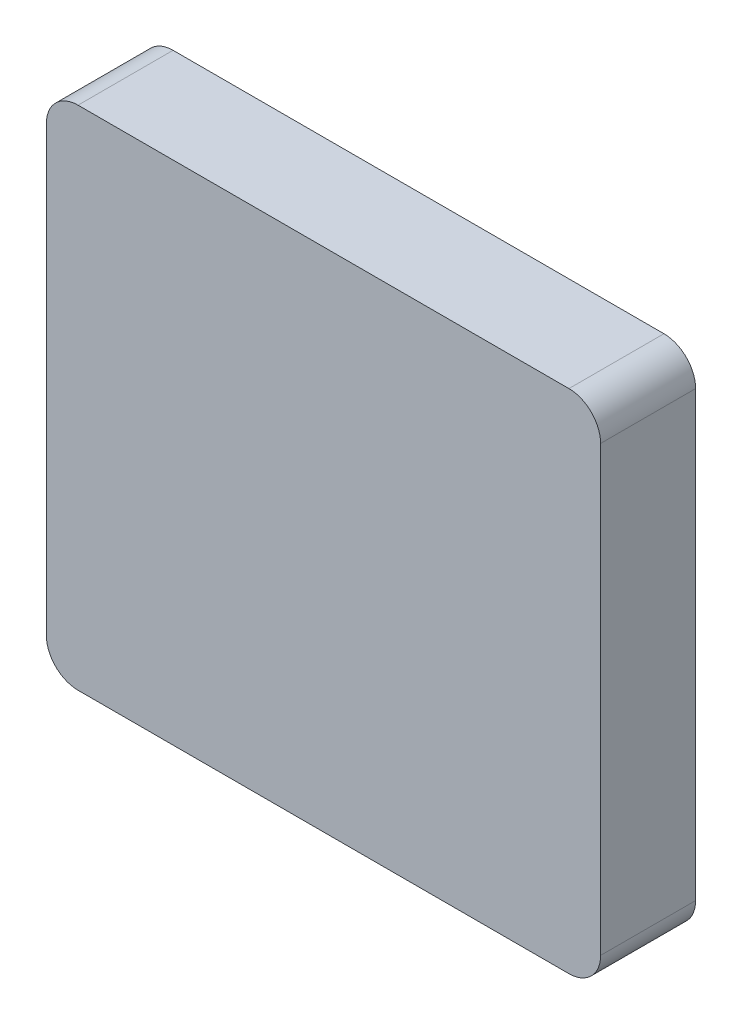
ISO-10303-21;
HEADER;
FILE_DESCRIPTION(('STEP AP214'),'2;1');
FILE_NAME('part.step','',(''),(''),'','','');
FILE_SCHEMA(('AUTOMOTIVE_DESIGN { 1 0 10303 214 1 1 1 1 }'));
ENDSEC;
DATA;
#1=APPLICATION_CONTEXT('core data for automotive mechanical design processes');
#2=APPLICATION_PROTOCOL_DEFINITION('international standard','automotive_design',2000,#1);
#3=PRODUCT_CONTEXT('',#1,'mechanical');
#4=PRODUCT('Part','Part','',(#3));
#5=PRODUCT_RELATED_PRODUCT_CATEGORY('part','',(#4));
#6=PRODUCT_DEFINITION_FORMATION('','',#4);
#7=PRODUCT_DEFINITION_CONTEXT('part definition',#1,'design');
#8=PRODUCT_DEFINITION('design','',#6,#7);
#9=PRODUCT_DEFINITION_SHAPE('','',#8);
#10=(LENGTH_UNIT() NAMED_UNIT(*) SI_UNIT(.MILLI.,.METRE.));
#11=(NAMED_UNIT(*) PLANE_ANGLE_UNIT() SI_UNIT($,.RADIAN.));
#12=(NAMED_UNIT(*) SI_UNIT($,.STERADIAN.) SOLID_ANGLE_UNIT());
#13=UNCERTAINTY_MEASURE_WITH_UNIT(LENGTH_MEASURE(1.E-05),#10,'distance_accuracy_value','');
#14=(GEOMETRIC_REPRESENTATION_CONTEXT(3) GLOBAL_UNCERTAINTY_ASSIGNED_CONTEXT((#13)) GLOBAL_UNIT_ASSIGNED_CONTEXT((#10,
#11,#12)) REPRESENTATION_CONTEXT('',''));
#15=CARTESIAN_POINT('',(0.,0.,0.));
#16=DIRECTION('',(0.,0.,1.));
#17=DIRECTION('',(1.,0.,0.));
#18=AXIS2_PLACEMENT_3D('',#15,#16,#17);
#19=CARTESIAN_POINT('',(-1.75,-1.6,2.6));
#20=DIRECTION('',(0.,0.,1.));
#21=DIRECTION('',(1.,0.,0.));
#22=AXIS2_PLACEMENT_3D('',#19,#20,#21);
#23=PLANE('',#22);
#24=DIRECTION('',(0.,1.,0.));
#25=VECTOR('',#24,1.);
#26=CARTESIAN_POINT('',(1.75,-1.6,2.6));
#27=LINE('',#26,#25);
#28=CARTESIAN_POINT('',(1.75,1.4,2.6));
#29=VERTEX_POINT('',#28);
#30=CARTESIAN_POINT('',(1.75,-1.4,2.6));
#31=VERTEX_POINT('',#30);
#32=EDGE_CURVE('E106',#29,#31,#27,.F.);
#33=ORIENTED_EDGE('',*,*,#32,.F.);
#34=CARTESIAN_POINT('',(1.55,1.4,2.6));
#35=DIRECTION('',(0.,0.,1.));
#36=DIRECTION('',(1.,0.,0.));
#37=AXIS2_PLACEMENT_3D('',#34,#35,#36);
#38=CIRCLE('',#37,0.2);
#39=CARTESIAN_POINT('',(1.55,1.6,2.6));
#40=VERTEX_POINT('',#39);
#41=EDGE_CURVE('E127',#40,#29,#38,.F.);
#42=ORIENTED_EDGE('',*,*,#41,.F.);
#43=DIRECTION('',(1.,0.,0.));
#44=VECTOR('',#43,1.);
#45=CARTESIAN_POINT('',(-1.75,1.6,2.6));
#46=LINE('',#45,#44);
#47=CARTESIAN_POINT('',(-1.55,1.6,2.6));
#48=VERTEX_POINT('',#47);
#49=EDGE_CURVE('E84',#48,#40,#46,.T.);
#50=ORIENTED_EDGE('',*,*,#49,.F.);
#51=CARTESIAN_POINT('',(-1.55,1.4,2.6));
#52=DIRECTION('',(0.,0.,1.));
#53=DIRECTION('',(1.,0.,0.));
#54=AXIS2_PLACEMENT_3D('',#51,#52,#53);
#55=CIRCLE('',#54,0.2);
#56=CARTESIAN_POINT('',(-1.75,1.4,2.6));
#57=VERTEX_POINT('',#56);
#58=EDGE_CURVE('E20',#57,#48,#55,.F.);
#59=ORIENTED_EDGE('',*,*,#58,.F.);
#60=DIRECTION('',(0.,1.,0.));
#61=VECTOR('',#60,1.);
#62=CARTESIAN_POINT('',(-1.75,-1.6,2.6));
#63=LINE('',#62,#61);
#64=CARTESIAN_POINT('',(-1.75,-1.4,2.6));
#65=VERTEX_POINT('',#64);
#66=EDGE_CURVE('E81',#57,#65,#63,.F.);
#67=ORIENTED_EDGE('',*,*,#66,.T.);
#68=CARTESIAN_POINT('',(-1.55,-1.4,2.6));
#69=DIRECTION('',(0.,0.,1.));
#70=DIRECTION('',(1.,0.,0.));
#71=AXIS2_PLACEMENT_3D('',#68,#69,#70);
#72=CIRCLE('',#71,0.2);
#73=CARTESIAN_POINT('',(-1.55,-1.6,2.6));
#74=VERTEX_POINT('',#73);
#75=EDGE_CURVE('E95',#74,#65,#72,.F.);
#76=ORIENTED_EDGE('',*,*,#75,.F.);
#77=DIRECTION('',(1.,0.,0.));
#78=VECTOR('',#77,1.);
#79=CARTESIAN_POINT('',(-1.75,-1.6,2.6));
#80=LINE('',#79,#78);
#81=CARTESIAN_POINT('',(1.55,-1.6,2.6));
#82=VERTEX_POINT('',#81);
#83=EDGE_CURVE('E110',#74,#82,#80,.T.);
#84=ORIENTED_EDGE('',*,*,#83,.T.);
#85=CARTESIAN_POINT('',(1.55,-1.4,2.6));
#86=DIRECTION('',(0.,0.,1.));
#87=DIRECTION('',(1.,0.,0.));
#88=AXIS2_PLACEMENT_3D('',#85,#86,#87);
#89=CIRCLE('',#88,0.2);
#90=EDGE_CURVE('E109',#31,#82,#89,.F.);
#91=ORIENTED_EDGE('',*,*,#90,.F.);
#92=EDGE_LOOP('',(#33,#42,#50,#59,#67,#76,#84,#91));
#93=FACE_BOUND('',#92,.T.);
#94=ADVANCED_FACE('F17',(#93),#23,.T.);
#95=CARTESIAN_POINT('',(-1.55,1.4,2.));
#96=DIRECTION('',(0.,0.,1.));
#97=DIRECTION('',(1.,0.,0.));
#98=AXIS2_PLACEMENT_3D('',#95,#96,#97);
#99=CYLINDRICAL_SURFACE('',#98,0.2);
#100=DIRECTION('',(0.,0.,-1.));
#101=VECTOR('',#100,1.);
#102=CARTESIAN_POINT('',(-1.75,1.4,2.));
#103=LINE('',#102,#101);
#104=CARTESIAN_POINT('',(-1.75,1.4,2.));
#105=VERTEX_POINT('',#104);
#106=EDGE_CURVE('E89',#105,#57,#103,.F.);
#107=ORIENTED_EDGE('',*,*,#106,.T.);
#108=ORIENTED_EDGE('',*,*,#58,.T.);
#109=DIRECTION('',(0.,0.,1.));
#110=VECTOR('',#109,1.);
#111=CARTESIAN_POINT('',(-1.55,1.6,2.));
#112=LINE('',#111,#110);
#113=CARTESIAN_POINT('',(-1.55,1.6,2.));
#114=VERTEX_POINT('',#113);
#115=EDGE_CURVE('E126',#114,#48,#112,.T.);
#116=ORIENTED_EDGE('',*,*,#115,.F.);
#117=CARTESIAN_POINT('',(-1.55,1.4,2.));
#118=DIRECTION('',(0.,0.,1.));
#119=DIRECTION('',(1.,0.,0.));
#120=AXIS2_PLACEMENT_3D('',#117,#118,#119);
#121=CIRCLE('',#120,0.2);
#122=EDGE_CURVE('E99',#114,#105,#121,.T.);
#123=ORIENTED_EDGE('',*,*,#122,.T.);
#124=EDGE_LOOP('',(#107,#108,#116,#123));
#125=FACE_BOUND('',#124,.T.);
#126=ADVANCED_FACE('F98',(#125),#99,.T.);
#127=CARTESIAN_POINT('',(-1.75,-1.6,2.));
#128=DIRECTION('',(1.,0.,0.));
#129=DIRECTION('',(0.,0.,-1.));
#130=AXIS2_PLACEMENT_3D('',#127,#128,#129);
#131=PLANE('',#130);
#132=DIRECTION('',(0.,0.,1.));
#133=VECTOR('',#132,1.);
#134=CARTESIAN_POINT('',(-1.75,-1.4,2.));
#135=LINE('',#134,#133);
#136=CARTESIAN_POINT('',(-1.75,-1.4,2.));
#137=VERTEX_POINT('',#136);
#138=EDGE_CURVE('E94',#65,#137,#135,.F.);
#139=ORIENTED_EDGE('',*,*,#138,.F.);
#140=ORIENTED_EDGE('',*,*,#66,.F.);
#141=ORIENTED_EDGE('',*,*,#106,.F.);
#142=DIRECTION('',(0.,1.,0.));
#143=VECTOR('',#142,1.);
#144=CARTESIAN_POINT('',(-1.75,-1.6,2.));
#145=LINE('',#144,#143);
#146=EDGE_CURVE('E124',#105,#137,#145,.F.);
#147=ORIENTED_EDGE('',*,*,#146,.T.);
#148=EDGE_LOOP('',(#139,#140,#141,#147));
#149=FACE_BOUND('',#148,.T.);
#150=ADVANCED_FACE('F91',(#149),#131,.F.);
#151=CARTESIAN_POINT('',(-1.55,-1.4,2.));
#152=DIRECTION('',(0.,0.,1.));
#153=DIRECTION('',(1.,0.,0.));
#154=AXIS2_PLACEMENT_3D('',#151,#152,#153);
#155=CYLINDRICAL_SURFACE('',#154,0.2);
#156=CARTESIAN_POINT('',(-1.55,-1.4,2.));
#157=DIRECTION('',(0.,0.,1.));
#158=DIRECTION('',(1.,0.,0.));
#159=AXIS2_PLACEMENT_3D('',#156,#157,#158);
#160=CIRCLE('',#159,0.2);
#161=CARTESIAN_POINT('',(-1.55,-1.6,2.));
#162=VERTEX_POINT('',#161);
#163=EDGE_CURVE('E121',#137,#162,#160,.T.);
#164=ORIENTED_EDGE('',*,*,#163,.T.);
#165=DIRECTION('',(0.,0.,1.));
#166=VECTOR('',#165,1.);
#167=CARTESIAN_POINT('',(-1.55,-1.6,2.));
#168=LINE('',#167,#166);
#169=EDGE_CURVE('E112',#162,#74,#168,.T.);
#170=ORIENTED_EDGE('',*,*,#169,.T.);
#171=ORIENTED_EDGE('',*,*,#75,.T.);
#172=ORIENTED_EDGE('',*,*,#138,.T.);
#173=EDGE_LOOP('',(#164,#170,#171,#172));
#174=FACE_BOUND('',#173,.T.);
#175=ADVANCED_FACE('F160',(#174),#155,.T.);
#176=CARTESIAN_POINT('',(-1.75,-1.6,2.));
#177=DIRECTION('',(0.,1.,0.));
#178=DIRECTION('',(0.,0.,1.));
#179=AXIS2_PLACEMENT_3D('',#176,#177,#178);
#180=PLANE('',#179);
#181=ORIENTED_EDGE('',*,*,#169,.F.);
#182=DIRECTION('',(1.,0.,0.));
#183=VECTOR('',#182,1.);
#184=CARTESIAN_POINT('',(-1.75,-1.6,2.));
#185=LINE('',#184,#183);
#186=CARTESIAN_POINT('',(1.55,-1.6,2.));
#187=VERTEX_POINT('',#186);
#188=EDGE_CURVE('E120',#162,#187,#185,.T.);
#189=ORIENTED_EDGE('',*,*,#188,.T.);
#190=DIRECTION('',(0.,0.,1.));
#191=VECTOR('',#190,1.);
#192=CARTESIAN_POINT('',(1.55,-1.6,2.));
#193=LINE('',#192,#191);
#194=EDGE_CURVE('E111',#82,#187,#193,.F.);
#195=ORIENTED_EDGE('',*,*,#194,.F.);
#196=ORIENTED_EDGE('',*,*,#83,.F.);
#197=EDGE_LOOP('',(#181,#189,#195,#196));
#198=FACE_BOUND('',#197,.T.);
#199=ADVANCED_FACE('F159',(#198),#180,.F.);
#200=CARTESIAN_POINT('',(1.55,-1.4,2.));
#201=DIRECTION('',(0.,0.,1.));
#202=DIRECTION('',(1.,0.,0.));
#203=AXIS2_PLACEMENT_3D('',#200,#201,#202);
#204=CYLINDRICAL_SURFACE('',#203,0.2);
#205=DIRECTION('',(0.,0.,-1.));
#206=VECTOR('',#205,1.);
#207=CARTESIAN_POINT('',(1.75,-1.4,2.));
#208=LINE('',#207,#206);
#209=CARTESIAN_POINT('',(1.75,-1.4,2.));
#210=VERTEX_POINT('',#209);
#211=EDGE_CURVE('E108',#31,#210,#208,.T.);
#212=ORIENTED_EDGE('',*,*,#211,.F.);
#213=ORIENTED_EDGE('',*,*,#90,.T.);
#214=ORIENTED_EDGE('',*,*,#194,.T.);
#215=CARTESIAN_POINT('',(1.55,-1.4,2.));
#216=DIRECTION('',(0.,0.,1.));
#217=DIRECTION('',(1.,0.,0.));
#218=AXIS2_PLACEMENT_3D('',#215,#216,#217);
#219=CIRCLE('',#218,0.2);
#220=EDGE_CURVE('E117',#187,#210,#219,.T.);
#221=ORIENTED_EDGE('',*,*,#220,.T.);
#222=EDGE_LOOP('',(#212,#213,#214,#221));
#223=FACE_BOUND('',#222,.T.);
#224=ADVANCED_FACE('F154',(#223),#204,.T.);
#225=CARTESIAN_POINT('',(1.75,-1.6,2.));
#226=DIRECTION('',(1.,0.,0.));
#227=DIRECTION('',(0.,0.,-1.));
#228=AXIS2_PLACEMENT_3D('',#225,#226,#227);
#229=PLANE('',#228);
#230=ORIENTED_EDGE('',*,*,#32,.T.);
#231=ORIENTED_EDGE('',*,*,#211,.T.);
#232=DIRECTION('',(0.,1.,0.));
#233=VECTOR('',#232,1.);
#234=CARTESIAN_POINT('',(1.75,-1.6,2.));
#235=LINE('',#234,#233);
#236=CARTESIAN_POINT('',(1.75,1.4,2.));
#237=VERTEX_POINT('',#236);
#238=EDGE_CURVE('E116',#210,#237,#235,.T.);
#239=ORIENTED_EDGE('',*,*,#238,.T.);
#240=DIRECTION('',(0.,0.,1.));
#241=VECTOR('',#240,1.);
#242=CARTESIAN_POINT('',(1.75,1.4,2.));
#243=LINE('',#242,#241);
#244=EDGE_CURVE('E105',#29,#237,#243,.F.);
#245=ORIENTED_EDGE('',*,*,#244,.F.);
#246=EDGE_LOOP('',(#230,#231,#239,#245));
#247=FACE_BOUND('',#246,.T.);
#248=ADVANCED_FACE('F146',(#247),#229,.T.);
#249=CARTESIAN_POINT('',(1.55,1.4,2.));
#250=DIRECTION('',(0.,0.,1.));
#251=DIRECTION('',(1.,0.,0.));
#252=AXIS2_PLACEMENT_3D('',#249,#250,#251);
#253=CYLINDRICAL_SURFACE('',#252,0.2);
#254=CARTESIAN_POINT('',(1.55,1.4,2.));
#255=DIRECTION('',(0.,0.,1.));
#256=DIRECTION('',(1.,0.,0.));
#257=AXIS2_PLACEMENT_3D('',#254,#255,#256);
#258=CIRCLE('',#257,0.2);
#259=CARTESIAN_POINT('',(1.55,1.6,2.));
#260=VERTEX_POINT('',#259);
#261=EDGE_CURVE('E26',#237,#260,#258,.T.);
#262=ORIENTED_EDGE('',*,*,#261,.T.);
#263=DIRECTION('',(0.,0.,1.));
#264=VECTOR('',#263,1.);
#265=CARTESIAN_POINT('',(1.55,1.6,2.));
#266=LINE('',#265,#264);
#267=EDGE_CURVE('E34',#40,#260,#266,.F.);
#268=ORIENTED_EDGE('',*,*,#267,.F.);
#269=ORIENTED_EDGE('',*,*,#41,.T.);
#270=ORIENTED_EDGE('',*,*,#244,.T.);
#271=EDGE_LOOP('',(#262,#268,#269,#270));
#272=FACE_BOUND('',#271,.T.);
#273=ADVANCED_FACE('F176',(#272),#253,.T.);
#274=CARTESIAN_POINT('',(-1.75,1.6,2.));
#275=DIRECTION('',(0.,1.,0.));
#276=DIRECTION('',(0.,0.,1.));
#277=AXIS2_PLACEMENT_3D('',#274,#275,#276);
#278=PLANE('',#277);
#279=DIRECTION('',(1.,0.,0.));
#280=VECTOR('',#279,1.);
#281=CARTESIAN_POINT('',(-1.75,1.6,2.));
#282=LINE('',#281,#280);
#283=EDGE_CURVE('E11',#260,#114,#282,.F.);
#284=ORIENTED_EDGE('',*,*,#283,.T.);
#285=ORIENTED_EDGE('',*,*,#115,.T.);
#286=ORIENTED_EDGE('',*,*,#49,.T.);
#287=ORIENTED_EDGE('',*,*,#267,.T.);
#288=EDGE_LOOP('',(#284,#285,#286,#287));
#289=FACE_BOUND('',#288,.T.);
#290=ADVANCED_FACE('F171',(#289),#278,.T.);
#291=CARTESIAN_POINT('',(-1.75,-1.6,2.));
#292=DIRECTION('',(0.,0.,1.));
#293=DIRECTION('',(1.,0.,0.));
#294=AXIS2_PLACEMENT_3D('',#291,#292,#293);
#295=PLANE('',#294);
#296=ORIENTED_EDGE('',*,*,#261,.F.);
#297=ORIENTED_EDGE('',*,*,#238,.F.);
#298=ORIENTED_EDGE('',*,*,#220,.F.);
#299=ORIENTED_EDGE('',*,*,#188,.F.);
#300=ORIENTED_EDGE('',*,*,#163,.F.);
#301=ORIENTED_EDGE('',*,*,#146,.F.);
#302=ORIENTED_EDGE('',*,*,#122,.F.);
#303=ORIENTED_EDGE('',*,*,#283,.F.);
#304=EDGE_LOOP('',(#296,#297,#298,#299,#300,#301,#302,#303));
#305=FACE_BOUND('',#304,.T.);
#306=ADVANCED_FACE('F151',(#305),#295,.F.);
#307=CLOSED_SHELL('',(#94,#126,#150,#175,#199,#224,#248,#273,#290,#306));
#308=MANIFOLD_SOLID_BREP('B1',#307);
#309=ADVANCED_BREP_SHAPE_REPRESENTATION('',(#18,#308),#14);
#310=SHAPE_DEFINITION_REPRESENTATION(#9,#309);
ENDSEC;
END-ISO-10303-21;
